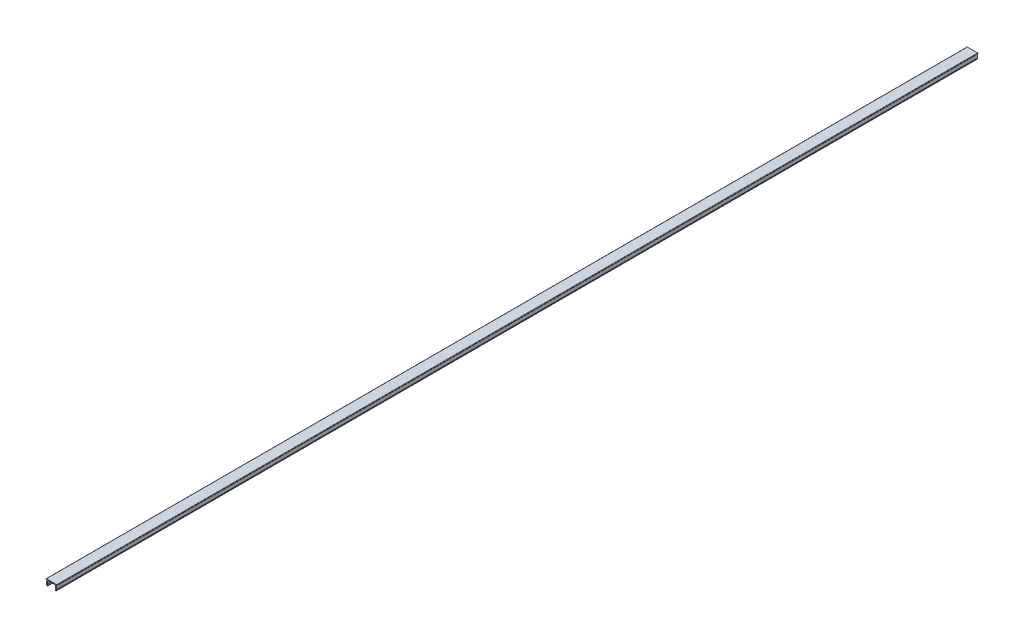
ISO-10303-21;
HEADER;
FILE_DESCRIPTION(('STEP AP214'),'2;1');
FILE_NAME('part.step','',(''),(''),'','','');
FILE_SCHEMA(('AUTOMOTIVE_DESIGN { 1 0 10303 214 1 1 1 1 }'));
ENDSEC;
DATA;
#1=APPLICATION_CONTEXT('core data for automotive mechanical design processes');
#2=APPLICATION_PROTOCOL_DEFINITION('international standard','automotive_design',2000,#1);
#3=PRODUCT_CONTEXT('',#1,'mechanical');
#4=PRODUCT('Part','Part','',(#3));
#5=PRODUCT_RELATED_PRODUCT_CATEGORY('part','',(#4));
#6=PRODUCT_DEFINITION_FORMATION('','',#4);
#7=PRODUCT_DEFINITION_CONTEXT('part definition',#1,'design');
#8=PRODUCT_DEFINITION('design','',#6,#7);
#9=PRODUCT_DEFINITION_SHAPE('','',#8);
#10=(LENGTH_UNIT() NAMED_UNIT(*) SI_UNIT(.MILLI.,.METRE.));
#11=(NAMED_UNIT(*) PLANE_ANGLE_UNIT() SI_UNIT($,.RADIAN.));
#12=(NAMED_UNIT(*) SI_UNIT($,.STERADIAN.) SOLID_ANGLE_UNIT());
#13=UNCERTAINTY_MEASURE_WITH_UNIT(LENGTH_MEASURE(1.E-05),#10,'distance_accuracy_value','');
#14=(GEOMETRIC_REPRESENTATION_CONTEXT(3) GLOBAL_UNCERTAINTY_ASSIGNED_CONTEXT((#13)) GLOBAL_UNIT_ASSIGNED_CONTEXT((#10,
#11,#12)) REPRESENTATION_CONTEXT('',''));
#15=CARTESIAN_POINT('',(0.,0.,0.));
#16=DIRECTION('',(0.,0.,1.));
#17=DIRECTION('',(1.,0.,0.));
#18=AXIS2_PLACEMENT_3D('',#15,#16,#17);
#19=CARTESIAN_POINT('',(-2.12833862518597,5.64999984480356,1000.));
#20=DIRECTION('',(0.,1.,0.));
#21=DIRECTION('',(-1.,0.,0.));
#22=AXIS2_PLACEMENT_3D('',#19,#20,#21);
#23=PLANE('',#22);
#24=DIRECTION('',(1.,0.,0.));
#25=VECTOR('',#24,1.);
#26=CARTESIAN_POINT('',(-2.12833862518597,5.64999984480356,0.));
#27=LINE('',#26,#25);
#28=CARTESIAN_POINT('',(0.26212001769372,5.64999984480356,0.));
#29=VERTEX_POINT('',#28);
#30=CARTESIAN_POINT('',(7.48120273193434,5.64999984480356,0.));
#31=VERTEX_POINT('',#30);
#32=EDGE_CURVE('E202',#29,#31,#27,.T.);
#33=ORIENTED_EDGE('',*,*,#32,.T.);
#34=DIRECTION('',(0.,0.,-1.));
#35=VECTOR('',#34,1.);
#36=CARTESIAN_POINT('',(7.48120273193434,5.64999984480356,1000.));
#37=LINE('',#36,#35);
#38=CARTESIAN_POINT('',(7.48120273193434,5.64999984480356,1000.));
#39=VERTEX_POINT('',#38);
#40=EDGE_CURVE('E244',#31,#39,#37,.F.);
#41=ORIENTED_EDGE('',*,*,#40,.T.);
#42=DIRECTION('',(1.,0.,0.));
#43=VECTOR('',#42,1.);
#44=CARTESIAN_POINT('',(-2.12833862518597,5.64999984480356,1000.));
#45=LINE('',#44,#43);
#46=CARTESIAN_POINT('',(0.26212001769372,5.64999984480356,1000.));
#47=VERTEX_POINT('',#46);
#48=EDGE_CURVE('E231',#47,#39,#45,.T.);
#49=ORIENTED_EDGE('',*,*,#48,.F.);
#50=DIRECTION('',(0.,0.,-1.));
#51=VECTOR('',#50,1.);
#52=CARTESIAN_POINT('',(0.26212001769372,5.64999984480356,1000.));
#53=LINE('',#52,#51);
#54=EDGE_CURVE('E241',#47,#29,#53,.T.);
#55=ORIENTED_EDGE('',*,*,#54,.T.);
#56=EDGE_LOOP('',(#33,#41,#49,#55));
#57=FACE_BOUND('',#56,.T.);
#58=ADVANCED_FACE('F15',(#57),#23,.F.);
#59=CARTESIAN_POINT('',(-1.62833862518597,5.64999984480356,1000.));
#60=VERTEX_POINT('',#59);
#61=CARTESIAN_POINT('',(-1.18984701639326,5.64999984480356,1000.));
#62=VERTEX_POINT('',#61);
#63=EDGE_CURVE('E229',#60,#62,#45,.T.);
#64=ORIENTED_EDGE('',*,*,#63,.F.);
#65=DIRECTION('',(0.,0.,-1.));
#66=VECTOR('',#65,1.);
#67=CARTESIAN_POINT('',(-1.62833862518597,5.64999984480356,0.));
#68=LINE('',#67,#66);
#69=CARTESIAN_POINT('',(-1.62833862518597,5.64999984480356,0.));
#70=VERTEX_POINT('',#69);
#71=EDGE_CURVE('E197',#60,#70,#68,.T.);
#72=ORIENTED_EDGE('',*,*,#71,.T.);
#73=CARTESIAN_POINT('',(-1.18984701639326,5.64999984480356,0.));
#74=VERTEX_POINT('',#73);
#75=EDGE_CURVE('E190',#70,#74,#27,.T.);
#76=ORIENTED_EDGE('',*,*,#75,.T.);
#77=DIRECTION('',(0.,0.,-1.));
#78=VECTOR('',#77,1.);
#79=CARTESIAN_POINT('',(-1.18984701639326,5.64999984480356,1000.));
#80=LINE('',#79,#78);
#81=EDGE_CURVE('E194',#62,#74,#80,.T.);
#82=ORIENTED_EDGE('',*,*,#81,.F.);
#83=EDGE_LOOP('',(#64,#72,#76,#82));
#84=FACE_BOUND('',#83,.T.);
#85=ADVANCED_FACE('F193',(#84),#23,.F.);
#86=CARTESIAN_POINT('',(8.93316976602132,5.64999984480356,0.));
#87=VERTEX_POINT('',#86);
#88=CARTESIAN_POINT('',(9.37166137481403,5.64999984480356,0.));
#89=VERTEX_POINT('',#88);
#90=EDGE_CURVE('E204',#87,#89,#27,.T.);
#91=ORIENTED_EDGE('',*,*,#90,.T.);
#92=DIRECTION('',(0.,0.,-1.));
#93=VECTOR('',#92,1.);
#94=CARTESIAN_POINT('',(9.37166137481403,5.64999984480356,1000.));
#95=LINE('',#94,#93);
#96=CARTESIAN_POINT('',(9.37166137481403,5.64999984480356,1000.));
#97=VERTEX_POINT('',#96);
#98=EDGE_CURVE('E319',#89,#97,#95,.F.);
#99=ORIENTED_EDGE('',*,*,#98,.T.);
#100=CARTESIAN_POINT('',(8.93316976602132,5.64999984480356,1000.));
#101=VERTEX_POINT('',#100);
#102=EDGE_CURVE('E232',#101,#97,#45,.T.);
#103=ORIENTED_EDGE('',*,*,#102,.F.);
#104=DIRECTION('',(0.,0.,-1.));
#105=VECTOR('',#104,1.);
#106=CARTESIAN_POINT('',(8.93316976602132,5.64999984480356,1000.));
#107=LINE('',#106,#105);
#108=EDGE_CURVE('E409',#101,#87,#107,.T.);
#109=ORIENTED_EDGE('',*,*,#108,.T.);
#110=EDGE_LOOP('',(#91,#99,#103,#109));
#111=FACE_BOUND('',#110,.T.);
#112=ADVANCED_FACE('F370',(#111),#23,.F.);
#113=CARTESIAN_POINT('',(-2.12833862518597,6.64999984480356,1000.));
#114=DIRECTION('',(0.,1.,0.));
#115=DIRECTION('',(-1.,0.,0.));
#116=AXIS2_PLACEMENT_3D('',#113,#114,#115);
#117=PLANE('',#116);
#118=DIRECTION('',(1.,0.,0.));
#119=VECTOR('',#118,1.);
#120=CARTESIAN_POINT('',(-2.12833862518597,6.64999984480356,1000.));
#121=LINE('',#120,#119);
#122=CARTESIAN_POINT('',(-1.62833862518597,6.64999984480356,1000.));
#123=VERTEX_POINT('',#122);
#124=CARTESIAN_POINT('',(9.37166137481403,6.64999984480356,1000.));
#125=VERTEX_POINT('',#124);
#126=EDGE_CURVE('E213',#123,#125,#121,.T.);
#127=ORIENTED_EDGE('',*,*,#126,.T.);
#128=DIRECTION('',(0.,0.,-1.));
#129=VECTOR('',#128,1.);
#130=CARTESIAN_POINT('',(9.37166137481403,6.64999984480356,1000.));
#131=LINE('',#130,#129);
#132=CARTESIAN_POINT('',(9.37166137481403,6.64999984480356,0.));
#133=VERTEX_POINT('',#132);
#134=EDGE_CURVE('E316',#125,#133,#131,.T.);
#135=ORIENTED_EDGE('',*,*,#134,.T.);
#136=DIRECTION('',(1.,0.,0.));
#137=VECTOR('',#136,1.);
#138=CARTESIAN_POINT('',(-2.12833862518597,6.64999984480356,0.));
#139=LINE('',#138,#137);
#140=CARTESIAN_POINT('',(-1.62833862518597,6.64999984480356,0.));
#141=VERTEX_POINT('',#140);
#142=EDGE_CURVE('E201',#141,#133,#139,.T.);
#143=ORIENTED_EDGE('',*,*,#142,.F.);
#144=DIRECTION('',(0.,0.,-1.));
#145=VECTOR('',#144,1.);
#146=CARTESIAN_POINT('',(-1.62833862518597,6.64999984480356,1000.));
#147=LINE('',#146,#145);
#148=EDGE_CURVE('E313',#141,#123,#147,.F.);
#149=ORIENTED_EDGE('',*,*,#148,.T.);
#150=EDGE_LOOP('',(#127,#135,#143,#149));
#151=FACE_BOUND('',#150,.T.);
#152=ADVANCED_FACE('F358',(#151),#117,.T.);
#153=CARTESIAN_POINT('',(0.,0.,1000.));
#154=DIRECTION('',(0.,0.,-1.));
#155=DIRECTION('',(-1.,0.,0.));
#156=AXIS2_PLACEMENT_3D('',#153,#154,#155);
#157=PLANE('',#156);
#158=DIRECTION('',(0.334719806751246,-0.942317701716575,0.));
#159=VECTOR('',#158,1.);
#160=CARTESIAN_POINT('',(-1.59949747604426,1.68263994142794,1000.));
#161=LINE('',#160,#159);
#162=CARTESIAN_POINT('',(-1.59949747604426,1.68263994142794,1000.));
#163=VERTEX_POINT('',#162);
#164=CARTESIAN_POINT('',(-1.19852284656922,0.553798792286223,1000.));
#165=VERTEX_POINT('',#164);
#166=EDGE_CURVE('E218',#163,#165,#161,.T.);
#167=ORIENTED_EDGE('',*,*,#166,.T.);
#168=CARTESIAN_POINT('',(-0.727363995710937,0.721158695661846,1000.));
#169=DIRECTION('',(0.,0.,-1.));
#170=DIRECTION('',(-1.,0.,0.));
#171=AXIS2_PLACEMENT_3D('',#168,#169,#170);
#172=CIRCLE('',#171,0.5);
#173=CARTESIAN_POINT('',(-0.560004092335314,0.249999844803559,1000.));
#174=VERTEX_POINT('',#173);
#175=EDGE_CURVE('E293',#165,#174,#172,.F.);
#176=ORIENTED_EDGE('',*,*,#175,.T.);
#177=CARTESIAN_POINT('',(-0.727363995710937,0.721158695661846,1000.));
#178=DIRECTION('',(0.,0.,-1.));
#179=DIRECTION('',(-1.,0.,0.));
#180=AXIS2_PLACEMENT_3D('',#177,#178,#179);
#181=CIRCLE('',#180,0.5);
#182=CARTESIAN_POINT('',(-0.25620514485265,0.888518599037469,1000.));
#183=VERTEX_POINT('',#182);
#184=EDGE_CURVE('E32',#174,#183,#181,.F.);
#185=ORIENTED_EDGE('',*,*,#184,.T.);
#186=DIRECTION('',(0.334719806751246,-0.942317701716575,0.));
#187=VECTOR('',#186,1.);
#188=CARTESIAN_POINT('',(-0.657179774327682,2.01735974817918,1000.));
#189=LINE('',#188,#187);
#190=CARTESIAN_POINT('',(-0.579324937996317,1.79817943987489,1000.));
#191=VERTEX_POINT('',#190);
#192=EDGE_CURVE('E222',#191,#183,#189,.T.);
#193=ORIENTED_EDGE('',*,*,#192,.F.);
#194=CARTESIAN_POINT('',(-0.108166087138029,1.96553934325051,1000.));
#195=DIRECTION('',(0.,0.,-1.));
#196=DIRECTION('',(-1.,0.,0.));
#197=AXIS2_PLACEMENT_3D('',#194,#195,#196);
#198=CIRCLE('',#197,0.5);
#199=CARTESIAN_POINT('',(-0.604819777288656,2.02328977233779,1000.));
#200=VERTEX_POINT('',#199);
#201=EDGE_CURVE('E9',#191,#200,#198,.T.);
#202=ORIENTED_EDGE('',*,*,#201,.T.);
#203=DIRECTION('',(-0.115500858174564,-0.993307380301254,0.));
#204=VECTOR('',#203,1.);
#205=CARTESIAN_POINT('',(-0.131684935035345,6.09224941571628,1000.));
#206=LINE('',#205,#204);
#207=CARTESIAN_POINT('',(-0.234533672456907,5.20775027389084,1000.));
#208=VERTEX_POINT('',#207);
#209=EDGE_CURVE('E413',#208,#200,#206,.T.);
#210=ORIENTED_EDGE('',*,*,#209,.F.);
#211=CARTESIAN_POINT('',(0.26212001769372,5.14999984480356,1000.));
#212=DIRECTION('',(0.,0.,-1.));
#213=DIRECTION('',(-1.,0.,0.));
#214=AXIS2_PLACEMENT_3D('',#211,#212,#213);
#215=CIRCLE('',#214,0.5);
#216=EDGE_CURVE('E328',#208,#47,#215,.T.);
#217=ORIENTED_EDGE('',*,*,#216,.T.);
#218=ORIENTED_EDGE('',*,*,#48,.T.);
#219=CARTESIAN_POINT('',(7.48120273193434,5.14999984480356,1000.));
#220=DIRECTION('',(0.,0.,-1.));
#221=DIRECTION('',(-1.,0.,0.));
#222=AXIS2_PLACEMENT_3D('',#219,#220,#221);
#223=CIRCLE('',#222,0.5);
#224=CARTESIAN_POINT('',(7.97785642208496,5.20775027389084,1000.));
#225=VERTEX_POINT('',#224);
#226=EDGE_CURVE('E324',#39,#225,#223,.T.);
#227=ORIENTED_EDGE('',*,*,#226,.T.);
#228=DIRECTION('',(0.115500858174564,-0.993307380301254,0.));
#229=VECTOR('',#228,1.);
#230=CARTESIAN_POINT('',(7.8750076846634,6.09224941571628,1000.));
#231=LINE('',#230,#229);
#232=CARTESIAN_POINT('',(8.34814252691671,2.02328977233779,1000.));
#233=VERTEX_POINT('',#232);
#234=EDGE_CURVE('E394',#225,#233,#231,.T.);
#235=ORIENTED_EDGE('',*,*,#234,.T.);
#236=CARTESIAN_POINT('',(7.85148883676609,1.96553934325051,1000.));
#237=DIRECTION('',(0.,0.,-1.));
#238=DIRECTION('',(-1.,0.,0.));
#239=AXIS2_PLACEMENT_3D('',#236,#237,#238);
#240=CIRCLE('',#239,0.5);
#241=CARTESIAN_POINT('',(8.32264768762438,1.79817943987488,1000.));
#242=VERTEX_POINT('',#241);
#243=EDGE_CURVE('E332',#233,#242,#240,.T.);
#244=ORIENTED_EDGE('',*,*,#243,.T.);
#245=DIRECTION('',(-0.334719806751245,-0.942317701716576,0.));
#246=VECTOR('',#245,1.);
#247=CARTESIAN_POINT('',(8.40050252395574,2.01735974817918,1000.));
#248=LINE('',#247,#246);
#249=CARTESIAN_POINT('',(7.99952789448071,0.888518599037471,1000.));
#250=VERTEX_POINT('',#249);
#251=EDGE_CURVE('E398',#242,#250,#248,.T.);
#252=ORIENTED_EDGE('',*,*,#251,.T.);
#253=CARTESIAN_POINT('',(8.470686745339,0.721158695661848,1000.));
#254=DIRECTION('',(0.,0.,-1.));
#255=DIRECTION('',(-1.,0.,0.));
#256=AXIS2_PLACEMENT_3D('',#253,#254,#255);
#257=CIRCLE('',#256,0.5);
#258=CARTESIAN_POINT('',(8.30332684196338,0.24999984480356,1000.));
#259=VERTEX_POINT('',#258);
#260=EDGE_CURVE('E288',#250,#259,#257,.F.);
#261=ORIENTED_EDGE('',*,*,#260,.T.);
#262=CARTESIAN_POINT('',(8.470686745339,0.721158695661848,1000.));
#263=DIRECTION('',(0.,0.,-1.));
#264=DIRECTION('',(-1.,0.,0.));
#265=AXIS2_PLACEMENT_3D('',#262,#263,#264);
#266=CIRCLE('',#265,0.5);
#267=CARTESIAN_POINT('',(8.94184559619729,0.553798792286225,1000.));
#268=VERTEX_POINT('',#267);
#269=EDGE_CURVE('E290',#259,#268,#266,.F.);
#270=ORIENTED_EDGE('',*,*,#269,.T.);
#271=DIRECTION('',(-0.334719806751245,-0.942317701716576,0.));
#272=VECTOR('',#271,1.);
#273=CARTESIAN_POINT('',(9.34282022567232,1.68263994142794,1000.));
#274=LINE('',#273,#272);
#275=CARTESIAN_POINT('',(9.34282022567232,1.68263994142794,1000.));
#276=VERTEX_POINT('',#275);
#277=EDGE_CURVE('E402',#276,#268,#274,.T.);
#278=ORIENTED_EDGE('',*,*,#277,.F.);
#279=CARTESIAN_POINT('',(8.87166137481403,1.84999984480356,1000.));
#280=DIRECTION('',(0.,0.,-1.));
#281=DIRECTION('',(-1.,0.,0.));
#282=AXIS2_PLACEMENT_3D('',#279,#280,#281);
#283=CIRCLE('',#282,0.5);
#284=CARTESIAN_POINT('',(9.36831506496466,1.90775027389084,1000.));
#285=VERTEX_POINT('',#284);
#286=EDGE_CURVE('E284',#276,#285,#283,.F.);
#287=ORIENTED_EDGE('',*,*,#286,.T.);
#288=DIRECTION('',(0.115500858174564,-0.993307380301254,0.));
#289=VECTOR('',#288,1.);
#290=CARTESIAN_POINT('',(8.86831506496466,6.20775027389084,1000.));
#291=LINE('',#290,#289);
#292=EDGE_CURVE('E374',#101,#285,#291,.T.);
#293=ORIENTED_EDGE('',*,*,#292,.F.);
#294=ORIENTED_EDGE('',*,*,#102,.T.);
#295=CARTESIAN_POINT('',(9.37166137481403,6.14999984480356,1000.));
#296=DIRECTION('',(0.,0.,-1.));
#297=DIRECTION('',(-1.,0.,0.));
#298=AXIS2_PLACEMENT_3D('',#295,#296,#297);
#299=CIRCLE('',#298,0.5);
#300=CARTESIAN_POINT('',(9.87166137481403,6.14999984480356,1000.));
#301=VERTEX_POINT('',#300);
#302=EDGE_CURVE('E280',#97,#301,#299,.F.);
#303=ORIENTED_EDGE('',*,*,#302,.T.);
#304=CARTESIAN_POINT('',(9.37166137481403,6.14999984480356,1000.));
#305=DIRECTION('',(0.,0.,-1.));
#306=DIRECTION('',(-1.,0.,0.));
#307=AXIS2_PLACEMENT_3D('',#304,#305,#306);
#308=CIRCLE('',#307,0.5);
#309=EDGE_CURVE('E282',#301,#125,#308,.F.);
#310=ORIENTED_EDGE('',*,*,#309,.T.);
#311=ORIENTED_EDGE('',*,*,#126,.F.);
#312=CARTESIAN_POINT('',(-1.62833862518597,6.14999984480356,1000.));
#313=DIRECTION('',(0.,0.,-1.));
#314=DIRECTION('',(-1.,0.,0.));
#315=AXIS2_PLACEMENT_3D('',#312,#313,#314);
#316=CIRCLE('',#315,0.5);
#317=CARTESIAN_POINT('',(-2.12833862518597,6.14999984480356,1000.));
#318=VERTEX_POINT('',#317);
#319=EDGE_CURVE('E278',#123,#318,#316,.F.);
#320=ORIENTED_EDGE('',*,*,#319,.T.);
#321=CARTESIAN_POINT('',(-1.62833862518597,6.14999984480356,1000.));
#322=DIRECTION('',(0.,0.,-1.));
#323=DIRECTION('',(-1.,0.,0.));
#324=AXIS2_PLACEMENT_3D('',#321,#322,#323);
#325=CIRCLE('',#324,0.5);
#326=EDGE_CURVE('E276',#318,#60,#325,.F.);
#327=ORIENTED_EDGE('',*,*,#326,.T.);
#328=ORIENTED_EDGE('',*,*,#63,.T.);
#329=DIRECTION('',(-0.115500858174564,-0.993307380301254,0.));
#330=VECTOR('',#329,1.);
#331=CARTESIAN_POINT('',(-1.1249923153366,6.20775027389084,1000.));
#332=LINE('',#331,#330);
#333=CARTESIAN_POINT('',(-1.6249923153366,1.90775027389084,1000.));
#334=VERTEX_POINT('',#333);
#335=EDGE_CURVE('E211',#62,#334,#332,.T.);
#336=ORIENTED_EDGE('',*,*,#335,.T.);
#337=CARTESIAN_POINT('',(-1.12833862518597,1.84999984480356,1000.));
#338=DIRECTION('',(0.,0.,-1.));
#339=DIRECTION('',(-1.,0.,0.));
#340=AXIS2_PLACEMENT_3D('',#337,#338,#339);
#341=CIRCLE('',#340,0.5);
#342=EDGE_CURVE('E286',#334,#163,#341,.F.);
#343=ORIENTED_EDGE('',*,*,#342,.T.);
#344=EDGE_LOOP('',(#167,#176,#185,#193,#202,#210,#217,#218,#227,#235,#244,#252,#261,#270,#278,
#287,#293,#294,#303,#310,#311,#320,#327,#328,#336,#343));
#345=FACE_BOUND('',#344,.T.);
#346=ADVANCED_FACE('F354',(#345),#157,.F.);
#347=CARTESIAN_POINT('',(0.,0.,0.));
#348=DIRECTION('',(0.,0.,-1.));
#349=DIRECTION('',(-1.,0.,0.));
#350=AXIS2_PLACEMENT_3D('',#347,#348,#349);
#351=PLANE('',#350);
#352=CARTESIAN_POINT('',(-0.727363995710937,0.721158695661846,0.));
#353=DIRECTION('',(0.,0.,-1.));
#354=DIRECTION('',(-1.,0.,0.));
#355=AXIS2_PLACEMENT_3D('',#352,#353,#354);
#356=CIRCLE('',#355,0.5);
#357=CARTESIAN_POINT('',(-0.25620514485265,0.888518599037469,0.));
#358=VERTEX_POINT('',#357);
#359=CARTESIAN_POINT('',(-0.560004092335314,0.249999844803559,0.));
#360=VERTEX_POINT('',#359);
#361=EDGE_CURVE('E266',#358,#360,#356,.T.);
#362=ORIENTED_EDGE('',*,*,#361,.T.);
#363=CARTESIAN_POINT('',(-0.727363995710937,0.721158695661846,0.));
#364=DIRECTION('',(0.,0.,-1.));
#365=DIRECTION('',(-1.,0.,0.));
#366=AXIS2_PLACEMENT_3D('',#363,#364,#365);
#367=CIRCLE('',#366,0.5);
#368=CARTESIAN_POINT('',(-1.19852284656922,0.553798792286223,0.));
#369=VERTEX_POINT('',#368);
#370=EDGE_CURVE('E268',#360,#369,#367,.T.);
#371=ORIENTED_EDGE('',*,*,#370,.T.);
#372=DIRECTION('',(0.334719806751246,-0.942317701716575,0.));
#373=VECTOR('',#372,1.);
#374=CARTESIAN_POINT('',(-1.59949747604426,1.68263994142794,0.));
#375=LINE('',#374,#373);
#376=CARTESIAN_POINT('',(-1.59949747604426,1.68263994142794,0.));
#377=VERTEX_POINT('',#376);
#378=EDGE_CURVE('E410',#377,#369,#375,.T.);
#379=ORIENTED_EDGE('',*,*,#378,.F.);
#380=CARTESIAN_POINT('',(-1.12833862518597,1.84999984480356,0.));
#381=DIRECTION('',(0.,0.,-1.));
#382=DIRECTION('',(-1.,0.,0.));
#383=AXIS2_PLACEMENT_3D('',#380,#381,#382);
#384=CIRCLE('',#383,0.5);
#385=CARTESIAN_POINT('',(-1.6249923153366,1.90775027389084,0.));
#386=VERTEX_POINT('',#385);
#387=EDGE_CURVE('E217',#377,#386,#384,.T.);
#388=ORIENTED_EDGE('',*,*,#387,.T.);
#389=DIRECTION('',(-0.115500858174564,-0.993307380301254,0.));
#390=VECTOR('',#389,1.);
#391=CARTESIAN_POINT('',(-1.1249923153366,6.20775027389084,0.));
#392=LINE('',#391,#390);
#393=EDGE_CURVE('E208',#74,#386,#392,.T.);
#394=ORIENTED_EDGE('',*,*,#393,.F.);
#395=ORIENTED_EDGE('',*,*,#75,.F.);
#396=CARTESIAN_POINT('',(-1.62833862518597,6.14999984480356,0.));
#397=DIRECTION('',(0.,0.,-1.));
#398=DIRECTION('',(-1.,0.,0.));
#399=AXIS2_PLACEMENT_3D('',#396,#397,#398);
#400=CIRCLE('',#399,0.5);
#401=CARTESIAN_POINT('',(-2.12833862518597,6.14999984480356,0.));
#402=VERTEX_POINT('',#401);
#403=EDGE_CURVE('E251',#70,#402,#400,.T.);
#404=ORIENTED_EDGE('',*,*,#403,.T.);
#405=CARTESIAN_POINT('',(-1.62833862518597,6.14999984480356,0.));
#406=DIRECTION('',(0.,0.,-1.));
#407=DIRECTION('',(-1.,0.,0.));
#408=AXIS2_PLACEMENT_3D('',#405,#406,#407);
#409=CIRCLE('',#408,0.5);
#410=EDGE_CURVE('E253',#402,#141,#409,.T.);
#411=ORIENTED_EDGE('',*,*,#410,.T.);
#412=ORIENTED_EDGE('',*,*,#142,.T.);
#413=CARTESIAN_POINT('',(9.37166137481403,6.14999984480356,0.));
#414=DIRECTION('',(0.,0.,-1.));
#415=DIRECTION('',(-1.,0.,0.));
#416=AXIS2_PLACEMENT_3D('',#413,#414,#415);
#417=CIRCLE('',#416,0.5);
#418=CARTESIAN_POINT('',(9.87166137481403,6.14999984480356,0.));
#419=VERTEX_POINT('',#418);
#420=EDGE_CURVE('E257',#133,#419,#417,.T.);
#421=ORIENTED_EDGE('',*,*,#420,.T.);
#422=CARTESIAN_POINT('',(9.37166137481403,6.14999984480356,0.));
#423=DIRECTION('',(0.,0.,-1.));
#424=DIRECTION('',(-1.,0.,0.));
#425=AXIS2_PLACEMENT_3D('',#422,#423,#424);
#426=CIRCLE('',#425,0.5);
#427=EDGE_CURVE('E255',#419,#89,#426,.T.);
#428=ORIENTED_EDGE('',*,*,#427,.T.);
#429=ORIENTED_EDGE('',*,*,#90,.F.);
#430=DIRECTION('',(0.115500858174564,-0.993307380301254,0.));
#431=VECTOR('',#430,1.);
#432=CARTESIAN_POINT('',(8.86831506496466,6.20775027389084,0.));
#433=LINE('',#432,#431);
#434=CARTESIAN_POINT('',(9.36831506496466,1.90775027389084,0.));
#435=VERTEX_POINT('',#434);
#436=EDGE_CURVE('E399',#87,#435,#433,.T.);
#437=ORIENTED_EDGE('',*,*,#436,.T.);
#438=CARTESIAN_POINT('',(8.87166137481403,1.84999984480356,0.));
#439=DIRECTION('',(0.,0.,-1.));
#440=DIRECTION('',(-1.,0.,0.));
#441=AXIS2_PLACEMENT_3D('',#438,#439,#440);
#442=CIRCLE('',#441,0.5);
#443=CARTESIAN_POINT('',(9.34282022567232,1.68263994142794,0.));
#444=VERTEX_POINT('',#443);
#445=EDGE_CURVE('E259',#435,#444,#442,.T.);
#446=ORIENTED_EDGE('',*,*,#445,.T.);
#447=DIRECTION('',(-0.334719806751245,-0.942317701716576,0.));
#448=VECTOR('',#447,1.);
#449=CARTESIAN_POINT('',(9.34282022567232,1.68263994142794,0.));
#450=LINE('',#449,#448);
#451=CARTESIAN_POINT('',(8.94184559619729,0.553798792286225,0.));
#452=VERTEX_POINT('',#451);
#453=EDGE_CURVE('E405',#444,#452,#450,.T.);
#454=ORIENTED_EDGE('',*,*,#453,.T.);
#455=CARTESIAN_POINT('',(8.470686745339,0.721158695661848,0.));
#456=DIRECTION('',(0.,0.,-1.));
#457=DIRECTION('',(-1.,0.,0.));
#458=AXIS2_PLACEMENT_3D('',#455,#456,#457);
#459=CIRCLE('',#458,0.5);
#460=CARTESIAN_POINT('',(8.30332684196338,0.24999984480356,0.));
#461=VERTEX_POINT('',#460);
#462=EDGE_CURVE('E264',#452,#461,#459,.T.);
#463=ORIENTED_EDGE('',*,*,#462,.T.);
#464=CARTESIAN_POINT('',(8.470686745339,0.721158695661848,0.));
#465=DIRECTION('',(0.,0.,-1.));
#466=DIRECTION('',(-1.,0.,0.));
#467=AXIS2_PLACEMENT_3D('',#464,#465,#466);
#468=CIRCLE('',#467,0.5);
#469=CARTESIAN_POINT('',(7.99952789448071,0.888518599037471,0.));
#470=VERTEX_POINT('',#469);
#471=EDGE_CURVE('E262',#461,#470,#468,.T.);
#472=ORIENTED_EDGE('',*,*,#471,.T.);
#473=DIRECTION('',(-0.334719806751245,-0.942317701716576,0.));
#474=VECTOR('',#473,1.);
#475=CARTESIAN_POINT('',(8.40050252395574,2.01735974817918,0.));
#476=LINE('',#475,#474);
#477=CARTESIAN_POINT('',(8.32264768762438,1.79817943987488,0.));
#478=VERTEX_POINT('',#477);
#479=EDGE_CURVE('E338',#478,#470,#476,.T.);
#480=ORIENTED_EDGE('',*,*,#479,.F.);
#481=CARTESIAN_POINT('',(7.85148883676609,1.96553934325051,0.));
#482=DIRECTION('',(0.,0.,-1.));
#483=DIRECTION('',(-1.,0.,0.));
#484=AXIS2_PLACEMENT_3D('',#481,#482,#483);
#485=CIRCLE('',#484,0.5);
#486=CARTESIAN_POINT('',(8.34814252691671,2.02328977233779,0.));
#487=VERTEX_POINT('',#486);
#488=EDGE_CURVE('E330',#478,#487,#485,.F.);
#489=ORIENTED_EDGE('',*,*,#488,.T.);
#490=DIRECTION('',(0.115500858174564,-0.993307380301254,0.));
#491=VECTOR('',#490,1.);
#492=CARTESIAN_POINT('',(7.8750076846634,6.09224941571628,0.));
#493=LINE('',#492,#491);
#494=CARTESIAN_POINT('',(7.97785642208496,5.20775027389084,0.));
#495=VERTEX_POINT('',#494);
#496=EDGE_CURVE('E392',#495,#487,#493,.T.);
#497=ORIENTED_EDGE('',*,*,#496,.F.);
#498=CARTESIAN_POINT('',(7.48120273193434,5.14999984480356,0.));
#499=DIRECTION('',(0.,0.,-1.));
#500=DIRECTION('',(-1.,0.,0.));
#501=AXIS2_PLACEMENT_3D('',#498,#499,#500);
#502=CIRCLE('',#501,0.5);
#503=EDGE_CURVE('E322',#495,#31,#502,.F.);
#504=ORIENTED_EDGE('',*,*,#503,.T.);
#505=ORIENTED_EDGE('',*,*,#32,.F.);
#506=CARTESIAN_POINT('',(0.26212001769372,5.14999984480356,0.));
#507=DIRECTION('',(0.,0.,-1.));
#508=DIRECTION('',(-1.,0.,0.));
#509=AXIS2_PLACEMENT_3D('',#506,#507,#508);
#510=CIRCLE('',#509,0.5);
#511=CARTESIAN_POINT('',(-0.234533672456907,5.20775027389084,0.));
#512=VERTEX_POINT('',#511);
#513=EDGE_CURVE('E326',#29,#512,#510,.F.);
#514=ORIENTED_EDGE('',*,*,#513,.T.);
#515=DIRECTION('',(-0.115500858174564,-0.993307380301254,0.));
#516=VECTOR('',#515,1.);
#517=CARTESIAN_POINT('',(-0.131684935035345,6.09224941571628,0.));
#518=LINE('',#517,#516);
#519=CARTESIAN_POINT('',(-0.604819777288656,2.02328977233779,0.));
#520=VERTEX_POINT('',#519);
#521=EDGE_CURVE('E219',#512,#520,#518,.T.);
#522=ORIENTED_EDGE('',*,*,#521,.T.);
#523=CARTESIAN_POINT('',(-0.108166087138029,1.96553934325051,0.));
#524=DIRECTION('',(0.,0.,-1.));
#525=DIRECTION('',(-1.,0.,0.));
#526=AXIS2_PLACEMENT_3D('',#523,#524,#525);
#527=CIRCLE('',#526,0.5);
#528=CARTESIAN_POINT('',(-0.579324937996317,1.79817943987489,0.));
#529=VERTEX_POINT('',#528);
#530=EDGE_CURVE('E24',#520,#529,#527,.F.);
#531=ORIENTED_EDGE('',*,*,#530,.T.);
#532=DIRECTION('',(0.334719806751246,-0.942317701716575,0.));
#533=VECTOR('',#532,1.);
#534=CARTESIAN_POINT('',(-0.657179774327682,2.01735974817918,0.));
#535=LINE('',#534,#533);
#536=EDGE_CURVE('E225',#529,#358,#535,.T.);
#537=ORIENTED_EDGE('',*,*,#536,.T.);
#538=EDGE_LOOP('',(#362,#371,#379,#388,#394,#395,#404,#411,#412,#421,#428,#429,#437,#446,#454,
#463,#472,#480,#489,#497,#504,#505,#514,#522,#531,#537));
#539=FACE_BOUND('',#538,.T.);
#540=ADVANCED_FACE('F215',(#539),#351,.T.);
#541=CARTESIAN_POINT('',(-0.131684935035345,6.09224941571628,1000.));
#542=DIRECTION('',(0.993307380301254,-0.115500858174564,0.));
#543=DIRECTION('',(0.115500858174564,0.993307380301254,0.));
#544=AXIS2_PLACEMENT_3D('',#541,#542,#543);
#545=PLANE('',#544);
#546=ORIENTED_EDGE('',*,*,#521,.F.);
#547=DIRECTION('',(0.,0.,-1.));
#548=VECTOR('',#547,1.);
#549=CARTESIAN_POINT('',(-0.234533672456907,5.20775027389084,1000.));
#550=LINE('',#549,#548);
#551=EDGE_CURVE('E249',#512,#208,#550,.F.);
#552=ORIENTED_EDGE('',*,*,#551,.T.);
#553=ORIENTED_EDGE('',*,*,#209,.T.);
#554=DIRECTION('',(0.,0.,-1.));
#555=VECTOR('',#554,1.);
#556=CARTESIAN_POINT('',(-0.604819777288656,2.02328977233779,0.));
#557=LINE('',#556,#555);
#558=EDGE_CURVE('E246',#200,#520,#557,.T.);
#559=ORIENTED_EDGE('',*,*,#558,.T.);
#560=EDGE_LOOP('',(#546,#552,#553,#559));
#561=FACE_BOUND('',#560,.T.);
#562=ADVANCED_FACE('F466',(#561),#545,.T.);
#563=CARTESIAN_POINT('',(-1.1249923153366,6.20775027389084,1000.));
#564=DIRECTION('',(0.993307380301254,-0.115500858174564,0.));
#565=DIRECTION('',(0.115500858174564,0.993307380301254,0.));
#566=AXIS2_PLACEMENT_3D('',#563,#564,#565);
#567=PLANE('',#566);
#568=ORIENTED_EDGE('',*,*,#393,.T.);
#569=DIRECTION('',(0.,0.,-1.));
#570=VECTOR('',#569,1.);
#571=CARTESIAN_POINT('',(-1.6249923153366,1.90775027389084,1000.));
#572=LINE('',#571,#570);
#573=EDGE_CURVE('E308',#386,#334,#572,.F.);
#574=ORIENTED_EDGE('',*,*,#573,.T.);
#575=ORIENTED_EDGE('',*,*,#335,.F.);
#576=ORIENTED_EDGE('',*,*,#81,.T.);
#577=EDGE_LOOP('',(#568,#574,#575,#576));
#578=FACE_BOUND('',#577,.T.);
#579=ADVANCED_FACE('F207',(#578),#567,.F.);
#580=CARTESIAN_POINT('',(-1.59949747604426,1.68263994142794,1000.));
#581=DIRECTION('',(0.942317701716575,0.334719806751246,0.));
#582=DIRECTION('',(-0.334719806751246,0.942317701716575,0.));
#583=AXIS2_PLACEMENT_3D('',#580,#581,#582);
#584=PLANE('',#583);
#585=ORIENTED_EDGE('',*,*,#378,.T.);
#586=DIRECTION('',(0.,0.,-1.));
#587=VECTOR('',#586,1.);
#588=CARTESIAN_POINT('',(-1.19852284656922,0.553798792286223,1000.));
#589=LINE('',#588,#587);
#590=EDGE_CURVE('E273',#369,#165,#589,.F.);
#591=ORIENTED_EDGE('',*,*,#590,.T.);
#592=ORIENTED_EDGE('',*,*,#166,.F.);
#593=DIRECTION('',(0.,0.,-1.));
#594=VECTOR('',#593,1.);
#595=CARTESIAN_POINT('',(-1.59949747604426,1.68263994142794,1000.));
#596=LINE('',#595,#594);
#597=EDGE_CURVE('E270',#163,#377,#596,.T.);
#598=ORIENTED_EDGE('',*,*,#597,.T.);
#599=EDGE_LOOP('',(#585,#591,#592,#598));
#600=FACE_BOUND('',#599,.T.);
#601=ADVANCED_FACE('F429',(#600),#584,.F.);
#602=CARTESIAN_POINT('',(-0.657179774327682,2.01735974817918,1000.));
#603=DIRECTION('',(0.942317701716575,0.334719806751246,0.));
#604=DIRECTION('',(-0.334719806751246,0.942317701716575,0.));
#605=AXIS2_PLACEMENT_3D('',#602,#603,#604);
#606=PLANE('',#605);
#607=ORIENTED_EDGE('',*,*,#192,.T.);
#608=DIRECTION('',(0.,0.,-1.));
#609=VECTOR('',#608,1.);
#610=CARTESIAN_POINT('',(-0.25620514485265,0.888518599037469,1000.));
#611=LINE('',#610,#609);
#612=EDGE_CURVE('E296',#183,#358,#611,.T.);
#613=ORIENTED_EDGE('',*,*,#612,.T.);
#614=ORIENTED_EDGE('',*,*,#536,.F.);
#615=DIRECTION('',(0.,0.,-1.));
#616=VECTOR('',#615,1.);
#617=CARTESIAN_POINT('',(-0.579324937996317,1.79817943987489,1000.));
#618=LINE('',#617,#616);
#619=EDGE_CURVE('E39',#529,#191,#618,.F.);
#620=ORIENTED_EDGE('',*,*,#619,.T.);
#621=EDGE_LOOP('',(#607,#613,#614,#620));
#622=FACE_BOUND('',#621,.T.);
#623=ADVANCED_FACE('F470',(#622),#606,.T.);
#624=CARTESIAN_POINT('',(8.86831506496466,6.20775027389084,1000.));
#625=DIRECTION('',(0.993307380301254,0.115500858174564,0.));
#626=DIRECTION('',(-0.115500858174564,0.993307380301254,0.));
#627=AXIS2_PLACEMENT_3D('',#624,#625,#626);
#628=PLANE('',#627);
#629=ORIENTED_EDGE('',*,*,#292,.T.);
#630=DIRECTION('',(0.,0.,-1.));
#631=VECTOR('',#630,1.);
#632=CARTESIAN_POINT('',(9.36831506496466,1.90775027389084,1000.));
#633=LINE('',#632,#631);
#634=EDGE_CURVE('E310',#285,#435,#633,.T.);
#635=ORIENTED_EDGE('',*,*,#634,.T.);
#636=ORIENTED_EDGE('',*,*,#436,.F.);
#637=ORIENTED_EDGE('',*,*,#108,.F.);
#638=EDGE_LOOP('',(#629,#635,#636,#637));
#639=FACE_BOUND('',#638,.T.);
#640=ADVANCED_FACE('F473',(#639),#628,.T.);
#641=CARTESIAN_POINT('',(7.8750076846634,6.09224941571628,1000.));
#642=DIRECTION('',(0.993307380301254,0.115500858174564,0.));
#643=DIRECTION('',(-0.115500858174564,0.993307380301254,0.));
#644=AXIS2_PLACEMENT_3D('',#641,#642,#643);
#645=PLANE('',#644);
#646=ORIENTED_EDGE('',*,*,#234,.F.);
#647=DIRECTION('',(0.,0.,-1.));
#648=VECTOR('',#647,1.);
#649=CARTESIAN_POINT('',(7.97785642208496,5.20775027389084,2.22044604925031E-13));
#650=LINE('',#649,#648);
#651=EDGE_CURVE('E238',#225,#495,#650,.T.);
#652=ORIENTED_EDGE('',*,*,#651,.T.);
#653=ORIENTED_EDGE('',*,*,#496,.T.);
#654=DIRECTION('',(0.,0.,-1.));
#655=VECTOR('',#654,1.);
#656=CARTESIAN_POINT('',(8.34814252691671,2.02328977233779,1000.));
#657=LINE('',#656,#655);
#658=EDGE_CURVE('E212',#487,#233,#657,.F.);
#659=ORIENTED_EDGE('',*,*,#658,.T.);
#660=EDGE_LOOP('',(#646,#652,#653,#659));
#661=FACE_BOUND('',#660,.T.);
#662=ADVANCED_FACE('F391',(#661),#645,.F.);
#663=CARTESIAN_POINT('',(8.40050252395574,2.01735974817918,1000.));
#664=DIRECTION('',(0.942317701716576,-0.334719806751245,0.));
#665=DIRECTION('',(0.334719806751245,0.942317701716576,0.));
#666=AXIS2_PLACEMENT_3D('',#663,#664,#665);
#667=PLANE('',#666);
#668=ORIENTED_EDGE('',*,*,#479,.T.);
#669=DIRECTION('',(0.,0.,-1.));
#670=VECTOR('',#669,1.);
#671=CARTESIAN_POINT('',(7.99952789448071,0.888518599037471,1000.));
#672=LINE('',#671,#670);
#673=EDGE_CURVE('E306',#470,#250,#672,.F.);
#674=ORIENTED_EDGE('',*,*,#673,.T.);
#675=ORIENTED_EDGE('',*,*,#251,.F.);
#676=DIRECTION('',(0.,0.,-1.));
#677=VECTOR('',#676,1.);
#678=CARTESIAN_POINT('',(8.32264768762438,1.79817943987488,2.22044604925031E-13));
#679=LINE('',#678,#677);
#680=EDGE_CURVE('E303',#242,#478,#679,.T.);
#681=ORIENTED_EDGE('',*,*,#680,.T.);
#682=EDGE_LOOP('',(#668,#674,#675,#681));
#683=FACE_BOUND('',#682,.T.);
#684=ADVANCED_FACE('F479',(#683),#667,.F.);
#685=CARTESIAN_POINT('',(9.34282022567232,1.68263994142794,1000.));
#686=DIRECTION('',(0.942317701716576,-0.334719806751245,0.));
#687=DIRECTION('',(0.334719806751245,0.942317701716576,0.));
#688=AXIS2_PLACEMENT_3D('',#685,#686,#687);
#689=PLANE('',#688);
#690=ORIENTED_EDGE('',*,*,#277,.T.);
#691=DIRECTION('',(0.,0.,-1.));
#692=VECTOR('',#691,1.);
#693=CARTESIAN_POINT('',(8.94184559619729,0.553798792286225,1000.));
#694=LINE('',#693,#692);
#695=EDGE_CURVE('E300',#268,#452,#694,.T.);
#696=ORIENTED_EDGE('',*,*,#695,.T.);
#697=ORIENTED_EDGE('',*,*,#453,.F.);
#698=DIRECTION('',(0.,0.,-1.));
#699=VECTOR('',#698,1.);
#700=CARTESIAN_POINT('',(9.34282022567232,1.68263994142794,1000.));
#701=LINE('',#700,#699);
#702=EDGE_CURVE('E298',#444,#276,#701,.F.);
#703=ORIENTED_EDGE('',*,*,#702,.T.);
#704=EDGE_LOOP('',(#690,#696,#697,#703));
#705=FACE_BOUND('',#704,.T.);
#706=ADVANCED_FACE('F482',(#705),#689,.T.);
#707=CARTESIAN_POINT('',(7.48120273193434,5.14999984480356,1000.));
#708=DIRECTION('',(0.,0.,1.));
#709=DIRECTION('',(1.,0.,0.));
#710=AXIS2_PLACEMENT_3D('',#707,#708,#709);
#711=CYLINDRICAL_SURFACE('',#710,0.5);
#712=ORIENTED_EDGE('',*,*,#226,.F.);
#713=ORIENTED_EDGE('',*,*,#40,.F.);
#714=ORIENTED_EDGE('',*,*,#503,.F.);
#715=ORIENTED_EDGE('',*,*,#651,.F.);
#716=EDGE_LOOP('',(#712,#713,#714,#715));
#717=FACE_BOUND('',#716,.T.);
#718=ADVANCED_FACE('F387',(#717),#711,.F.);
#719=CARTESIAN_POINT('',(0.26212001769372,5.14999984480356,1000.));
#720=DIRECTION('',(0.,0.,-1.));
#721=DIRECTION('',(-1.,0.,0.));
#722=AXIS2_PLACEMENT_3D('',#719,#720,#721);
#723=CYLINDRICAL_SURFACE('',#722,0.5);
#724=ORIENTED_EDGE('',*,*,#216,.F.);
#725=ORIENTED_EDGE('',*,*,#551,.F.);
#726=ORIENTED_EDGE('',*,*,#513,.F.);
#727=ORIENTED_EDGE('',*,*,#54,.F.);
#728=EDGE_LOOP('',(#724,#725,#726,#727));
#729=FACE_BOUND('',#728,.T.);
#730=ADVANCED_FACE('F514',(#729),#723,.F.);
#731=CARTESIAN_POINT('',(-0.727363995710937,0.721158695661846,1000.));
#732=DIRECTION('',(0.,0.,-1.));
#733=DIRECTION('',(-1.,0.,0.));
#734=AXIS2_PLACEMENT_3D('',#731,#732,#733);
#735=CYLINDRICAL_SURFACE('',#734,0.5);
#736=ORIENTED_EDGE('',*,*,#612,.F.);
#737=ORIENTED_EDGE('',*,*,#184,.F.);
#738=DIRECTION('',(0.,0.,-1.));
#739=VECTOR('',#738,1.);
#740=CARTESIAN_POINT('',(-0.560004092335314,0.249999844803559,1000.));
#741=LINE('',#740,#739);
#742=EDGE_CURVE('E335',#360,#174,#741,.F.);
#743=ORIENTED_EDGE('',*,*,#742,.F.);
#744=ORIENTED_EDGE('',*,*,#361,.F.);
#745=EDGE_LOOP('',(#736,#737,#743,#744));
#746=FACE_BOUND('',#745,.T.);
#747=ADVANCED_FACE('F423',(#746),#735,.T.);
#748=CARTESIAN_POINT('',(-0.727363995710937,0.721158695661846,1000.));
#749=DIRECTION('',(0.,0.,1.));
#750=DIRECTION('',(1.,0.,0.));
#751=AXIS2_PLACEMENT_3D('',#748,#749,#750);
#752=CYLINDRICAL_SURFACE('',#751,0.5);
#753=ORIENTED_EDGE('',*,*,#175,.F.);
#754=ORIENTED_EDGE('',*,*,#590,.F.);
#755=ORIENTED_EDGE('',*,*,#370,.F.);
#756=ORIENTED_EDGE('',*,*,#742,.T.);
#757=EDGE_LOOP('',(#753,#754,#755,#756));
#758=FACE_BOUND('',#757,.T.);
#759=ADVANCED_FACE('F427',(#758),#752,.T.);
#760=CARTESIAN_POINT('',(8.470686745339,0.721158695661848,1000.));
#761=DIRECTION('',(0.,0.,1.));
#762=DIRECTION('',(1.,0.,0.));
#763=AXIS2_PLACEMENT_3D('',#760,#761,#762);
#764=CYLINDRICAL_SURFACE('',#763,0.5);
#765=DIRECTION('',(0.,0.,-1.));
#766=VECTOR('',#765,1.);
#767=CARTESIAN_POINT('',(8.30332684196338,0.249999844803559,0.));
#768=LINE('',#767,#766);
#769=EDGE_CURVE('E339',#259,#461,#768,.T.);
#770=ORIENTED_EDGE('',*,*,#769,.F.);
#771=ORIENTED_EDGE('',*,*,#260,.F.);
#772=ORIENTED_EDGE('',*,*,#673,.F.);
#773=ORIENTED_EDGE('',*,*,#471,.F.);
#774=EDGE_LOOP('',(#770,#771,#772,#773));
#775=FACE_BOUND('',#774,.T.);
#776=ADVANCED_FACE('F536',(#775),#764,.T.);
#777=CARTESIAN_POINT('',(8.470686745339,0.721158695661848,1000.));
#778=DIRECTION('',(0.,0.,-1.));
#779=DIRECTION('',(-1.,0.,0.));
#780=AXIS2_PLACEMENT_3D('',#777,#778,#779);
#781=CYLINDRICAL_SURFACE('',#780,0.5);
#782=ORIENTED_EDGE('',*,*,#269,.F.);
#783=ORIENTED_EDGE('',*,*,#769,.T.);
#784=ORIENTED_EDGE('',*,*,#462,.F.);
#785=ORIENTED_EDGE('',*,*,#695,.F.);
#786=EDGE_LOOP('',(#782,#783,#784,#785));
#787=FACE_BOUND('',#786,.T.);
#788=ADVANCED_FACE('F544',(#787),#781,.T.);
#789=CARTESIAN_POINT('',(7.85148883676609,1.96553934325051,1000.));
#790=DIRECTION('',(0.,0.,1.));
#791=DIRECTION('',(1.,0.,0.));
#792=AXIS2_PLACEMENT_3D('',#789,#790,#791);
#793=CYLINDRICAL_SURFACE('',#792,0.5);
#794=ORIENTED_EDGE('',*,*,#243,.F.);
#795=ORIENTED_EDGE('',*,*,#658,.F.);
#796=ORIENTED_EDGE('',*,*,#488,.F.);
#797=ORIENTED_EDGE('',*,*,#680,.F.);
#798=EDGE_LOOP('',(#794,#795,#796,#797));
#799=FACE_BOUND('',#798,.T.);
#800=ADVANCED_FACE('F446',(#799),#793,.F.);
#801=CARTESIAN_POINT('',(-0.108166087138029,1.96553934325051,1000.));
#802=DIRECTION('',(0.,0.,1.));
#803=DIRECTION('',(1.,0.,0.));
#804=AXIS2_PLACEMENT_3D('',#801,#802,#803);
#805=CYLINDRICAL_SURFACE('',#804,0.5);
#806=ORIENTED_EDGE('',*,*,#201,.F.);
#807=ORIENTED_EDGE('',*,*,#619,.F.);
#808=ORIENTED_EDGE('',*,*,#530,.F.);
#809=ORIENTED_EDGE('',*,*,#558,.F.);
#810=EDGE_LOOP('',(#806,#807,#808,#809));
#811=FACE_BOUND('',#810,.T.);
#812=ADVANCED_FACE('F437',(#811),#805,.F.);
#813=CARTESIAN_POINT('',(-1.12833862518597,1.84999984480356,1000.));
#814=DIRECTION('',(0.,0.,-1.));
#815=DIRECTION('',(-1.,0.,0.));
#816=AXIS2_PLACEMENT_3D('',#813,#814,#815);
#817=CYLINDRICAL_SURFACE('',#816,0.5);
#818=ORIENTED_EDGE('',*,*,#342,.F.);
#819=ORIENTED_EDGE('',*,*,#573,.F.);
#820=ORIENTED_EDGE('',*,*,#387,.F.);
#821=ORIENTED_EDGE('',*,*,#597,.F.);
#822=EDGE_LOOP('',(#818,#819,#820,#821));
#823=FACE_BOUND('',#822,.T.);
#824=ADVANCED_FACE('F434',(#823),#817,.T.);
#825=CARTESIAN_POINT('',(8.87166137481403,1.84999984480356,1000.));
#826=DIRECTION('',(0.,0.,-1.));
#827=DIRECTION('',(-1.,0.,0.));
#828=AXIS2_PLACEMENT_3D('',#825,#826,#827);
#829=CYLINDRICAL_SURFACE('',#828,0.5);
#830=ORIENTED_EDGE('',*,*,#286,.F.);
#831=ORIENTED_EDGE('',*,*,#702,.F.);
#832=ORIENTED_EDGE('',*,*,#445,.F.);
#833=ORIENTED_EDGE('',*,*,#634,.F.);
#834=EDGE_LOOP('',(#830,#831,#832,#833));
#835=FACE_BOUND('',#834,.T.);
#836=ADVANCED_FACE('F436',(#835),#829,.T.);
#837=CARTESIAN_POINT('',(9.37166137481403,6.14999984480356,1000.));
#838=DIRECTION('',(0.,0.,1.));
#839=DIRECTION('',(1.,0.,0.));
#840=AXIS2_PLACEMENT_3D('',#837,#838,#839);
#841=CYLINDRICAL_SURFACE('',#840,0.5);
#842=DIRECTION('',(0.,0.,-1.));
#843=VECTOR('',#842,1.);
#844=CARTESIAN_POINT('',(9.87166137481403,6.14999984480356,0.));
#845=LINE('',#844,#843);
#846=EDGE_CURVE('E341',#301,#419,#845,.T.);
#847=ORIENTED_EDGE('',*,*,#846,.F.);
#848=ORIENTED_EDGE('',*,*,#302,.F.);
#849=ORIENTED_EDGE('',*,*,#98,.F.);
#850=ORIENTED_EDGE('',*,*,#427,.F.);
#851=EDGE_LOOP('',(#847,#848,#849,#850));
#852=FACE_BOUND('',#851,.T.);
#853=ADVANCED_FACE('F366',(#852),#841,.T.);
#854=CARTESIAN_POINT('',(9.37166137481403,6.14999984480356,1000.));
#855=DIRECTION('',(0.,0.,-1.));
#856=DIRECTION('',(-1.,0.,0.));
#857=AXIS2_PLACEMENT_3D('',#854,#855,#856);
#858=CYLINDRICAL_SURFACE('',#857,0.5);
#859=ORIENTED_EDGE('',*,*,#309,.F.);
#860=ORIENTED_EDGE('',*,*,#846,.T.);
#861=ORIENTED_EDGE('',*,*,#420,.F.);
#862=ORIENTED_EDGE('',*,*,#134,.F.);
#863=EDGE_LOOP('',(#859,#860,#861,#862));
#864=FACE_BOUND('',#863,.T.);
#865=ADVANCED_FACE('F360',(#864),#858,.T.);
#866=CARTESIAN_POINT('',(-1.62833862518597,6.14999984480356,1000.));
#867=DIRECTION('',(0.,0.,1.));
#868=DIRECTION('',(1.,0.,0.));
#869=AXIS2_PLACEMENT_3D('',#866,#867,#868);
#870=CYLINDRICAL_SURFACE('',#869,0.5);
#871=ORIENTED_EDGE('',*,*,#71,.F.);
#872=ORIENTED_EDGE('',*,*,#326,.F.);
#873=DIRECTION('',(0.,0.,-1.));
#874=VECTOR('',#873,1.);
#875=CARTESIAN_POINT('',(-2.12833862518597,6.14999984480356,1000.));
#876=LINE('',#875,#874);
#877=EDGE_CURVE('E19',#402,#318,#876,.F.);
#878=ORIENTED_EDGE('',*,*,#877,.F.);
#879=ORIENTED_EDGE('',*,*,#403,.F.);
#880=EDGE_LOOP('',(#871,#872,#878,#879));
#881=FACE_BOUND('',#880,.T.);
#882=ADVANCED_FACE('F17',(#881),#870,.T.);
#883=CARTESIAN_POINT('',(-1.62833862518597,6.14999984480356,1000.));
#884=DIRECTION('',(0.,0.,-1.));
#885=DIRECTION('',(-1.,0.,0.));
#886=AXIS2_PLACEMENT_3D('',#883,#884,#885);
#887=CYLINDRICAL_SURFACE('',#886,0.5);
#888=ORIENTED_EDGE('',*,*,#319,.F.);
#889=ORIENTED_EDGE('',*,*,#148,.F.);
#890=ORIENTED_EDGE('',*,*,#410,.F.);
#891=ORIENTED_EDGE('',*,*,#877,.T.);
#892=EDGE_LOOP('',(#888,#889,#890,#891));
#893=FACE_BOUND('',#892,.T.);
#894=ADVANCED_FACE('F350',(#893),#887,.T.);
#895=CLOSED_SHELL('',(#58,#85,#112,#152,#346,#540,#562,#579,#601,#623,#640,#662,#684,#706,#718,
#730,#747,#759,#776,#788,#800,#812,#824,#836,#853,#865,#882,#894));
#896=MANIFOLD_SOLID_BREP('B1',#895);
#897=ADVANCED_BREP_SHAPE_REPRESENTATION('',(#18,#896),#14);
#898=SHAPE_DEFINITION_REPRESENTATION(#9,#897);
ENDSEC;
END-ISO-10303-21;
